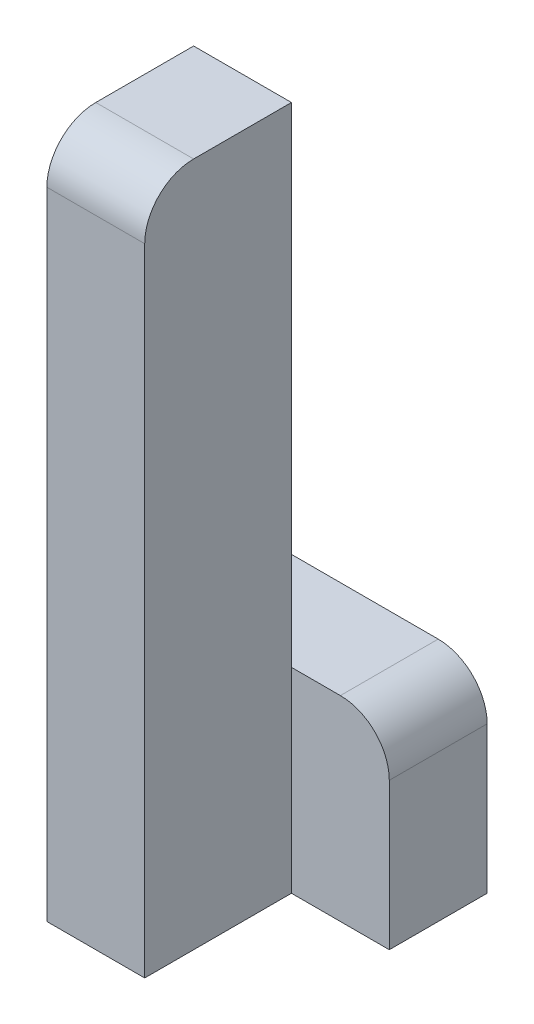
ISO-10303-21;
HEADER;
FILE_DESCRIPTION(('STEP AP214'),'2;1');
FILE_NAME('part.step','',(''),(''),'','','');
FILE_SCHEMA(('AUTOMOTIVE_DESIGN { 1 0 10303 214 1 1 1 1 }'));
ENDSEC;
DATA;
#1=APPLICATION_CONTEXT('core data for automotive mechanical design processes');
#2=APPLICATION_PROTOCOL_DEFINITION('international standard','automotive_design',2000,#1);
#3=PRODUCT_CONTEXT('',#1,'mechanical');
#4=PRODUCT('Part','Part','',(#3));
#5=PRODUCT_RELATED_PRODUCT_CATEGORY('part','',(#4));
#6=PRODUCT_DEFINITION_FORMATION('','',#4);
#7=PRODUCT_DEFINITION_CONTEXT('part definition',#1,'design');
#8=PRODUCT_DEFINITION('design','',#6,#7);
#9=PRODUCT_DEFINITION_SHAPE('','',#8);
#10=(LENGTH_UNIT() NAMED_UNIT(*) SI_UNIT(.MILLI.,.METRE.));
#11=(NAMED_UNIT(*) PLANE_ANGLE_UNIT() SI_UNIT($,.RADIAN.));
#12=(NAMED_UNIT(*) SI_UNIT($,.STERADIAN.) SOLID_ANGLE_UNIT());
#13=UNCERTAINTY_MEASURE_WITH_UNIT(LENGTH_MEASURE(1.E-05),#10,'distance_accuracy_value','');
#14=(GEOMETRIC_REPRESENTATION_CONTEXT(3) GLOBAL_UNCERTAINTY_ASSIGNED_CONTEXT((#13)) GLOBAL_UNIT_ASSIGNED_CONTEXT((#10,
#11,#12)) REPRESENTATION_CONTEXT('',''));
#15=CARTESIAN_POINT('',(0.,0.,0.));
#16=DIRECTION('',(0.,0.,1.));
#17=DIRECTION('',(1.,0.,0.));
#18=AXIS2_PLACEMENT_3D('',#15,#16,#17);
#19=CARTESIAN_POINT('',(-10.,0.,30.));
#20=DIRECTION('',(0.,-1.,0.));
#21=DIRECTION('',(1.,0.,0.));
#22=AXIS2_PLACEMENT_3D('',#19,#20,#21);
#23=PLANE('',#22);
#24=DIRECTION('',(0.,0.,-1.));
#25=VECTOR('',#24,1.);
#26=CARTESIAN_POINT('',(-30.,0.,30.));
#27=LINE('',#26,#25);
#28=CARTESIAN_POINT('',(-30.,0.,20.));
#29=VERTEX_POINT('',#28);
#30=CARTESIAN_POINT('',(-30.,0.,0.));
#31=VERTEX_POINT('',#30);
#32=EDGE_CURVE('E171',#29,#31,#27,.T.);
#33=ORIENTED_EDGE('',*,*,#32,.F.);
#34=DIRECTION('',(-1.,0.,0.));
#35=VECTOR('',#34,1.);
#36=CARTESIAN_POINT('',(-10.,0.,20.));
#37=LINE('',#36,#35);
#38=CARTESIAN_POINT('',(-10.,0.,20.));
#39=VERTEX_POINT('',#38);
#40=EDGE_CURVE('E43',#29,#39,#37,.F.);
#41=ORIENTED_EDGE('',*,*,#40,.T.);
#42=DIRECTION('',(0.,0.,-1.));
#43=VECTOR('',#42,1.);
#44=CARTESIAN_POINT('',(-10.,0.,30.));
#45=LINE('',#44,#43);
#46=CARTESIAN_POINT('',(-10.,0.,0.));
#47=VERTEX_POINT('',#46);
#48=EDGE_CURVE('E158',#39,#47,#45,.T.);
#49=ORIENTED_EDGE('',*,*,#48,.T.);
#50=DIRECTION('',(-1.,0.,0.));
#51=VECTOR('',#50,1.);
#52=CARTESIAN_POINT('',(-10.,0.,0.));
#53=LINE('',#52,#51);
#54=EDGE_CURVE('E148',#47,#31,#53,.T.);
#55=ORIENTED_EDGE('',*,*,#54,.T.);
#56=EDGE_LOOP('',(#33,#41,#49,#55));
#57=FACE_BOUND('',#56,.T.);
#58=ADVANCED_FACE('F35',(#57),#23,.F.);
#59=CARTESIAN_POINT('',(-30.,0.,30.));
#60=DIRECTION('',(1.,0.,0.));
#61=DIRECTION('',(0.,0.,-1.));
#62=AXIS2_PLACEMENT_3D('',#59,#60,#61);
#63=PLANE('',#62);
#64=DIRECTION('',(0.,-1.,0.));
#65=VECTOR('',#64,1.);
#66=CARTESIAN_POINT('',(-30.,0.,30.));
#67=LINE('',#66,#65);
#68=CARTESIAN_POINT('',(-30.,-10.,30.));
#69=VERTEX_POINT('',#68);
#70=CARTESIAN_POINT('',(-30.,-140.,30.));
#71=VERTEX_POINT('',#70);
#72=EDGE_CURVE('E150',#69,#71,#67,.T.);
#73=ORIENTED_EDGE('',*,*,#72,.F.);
#74=CARTESIAN_POINT('',(-30.,-10.,20.));
#75=DIRECTION('',(1.,0.,0.));
#76=DIRECTION('',(0.,0.,-1.));
#77=AXIS2_PLACEMENT_3D('',#74,#75,#76);
#78=CIRCLE('',#77,10.);
#79=EDGE_CURVE('E57',#69,#29,#78,.F.);
#80=ORIENTED_EDGE('',*,*,#79,.T.);
#81=ORIENTED_EDGE('',*,*,#32,.T.);
#82=DIRECTION('',(0.,-1.,0.));
#83=VECTOR('',#82,1.);
#84=CARTESIAN_POINT('',(-30.,0.,0.));
#85=LINE('',#84,#83);
#86=CARTESIAN_POINT('',(-30.,-100.,0.));
#87=VERTEX_POINT('',#86);
#88=EDGE_CURVE('E126',#31,#87,#85,.T.);
#89=ORIENTED_EDGE('',*,*,#88,.T.);
#90=DIRECTION('',(0.,0.,1.));
#91=VECTOR('',#90,1.);
#92=CARTESIAN_POINT('',(-30.,-100.,-20.));
#93=LINE('',#92,#91);
#94=CARTESIAN_POINT('',(-30.,-100.,-20.));
#95=VERTEX_POINT('',#94);
#96=EDGE_CURVE('E111',#95,#87,#93,.T.);
#97=ORIENTED_EDGE('',*,*,#96,.F.);
#98=DIRECTION('',(0.,-1.,0.));
#99=VECTOR('',#98,1.);
#100=CARTESIAN_POINT('',(-30.,-100.,-20.));
#101=LINE('',#100,#99);
#102=CARTESIAN_POINT('',(-30.,-140.,-20.));
#103=VERTEX_POINT('',#102);
#104=EDGE_CURVE('E118',#95,#103,#101,.T.);
#105=ORIENTED_EDGE('',*,*,#104,.T.);
#106=DIRECTION('',(0.,0.,-1.));
#107=VECTOR('',#106,1.);
#108=CARTESIAN_POINT('',(-30.,-140.,30.));
#109=LINE('',#108,#107);
#110=EDGE_CURVE('E169',#71,#103,#109,.T.);
#111=ORIENTED_EDGE('',*,*,#110,.F.);
#112=EDGE_LOOP('',(#73,#80,#81,#89,#97,#105,#111));
#113=FACE_BOUND('',#112,.T.);
#114=ADVANCED_FACE('F123',(#113),#63,.F.);
#115=CARTESIAN_POINT('',(-30.,-140.,30.));
#116=DIRECTION('',(0.,1.,0.));
#117=DIRECTION('',(0.,0.,1.));
#118=AXIS2_PLACEMENT_3D('',#115,#116,#117);
#119=PLANE('',#118);
#120=ORIENTED_EDGE('',*,*,#110,.T.);
#121=DIRECTION('',(1.,0.,0.));
#122=VECTOR('',#121,1.);
#123=CARTESIAN_POINT('',(-30.,-140.,-20.));
#124=LINE('',#123,#122);
#125=CARTESIAN_POINT('',(10.,-140.,-20.));
#126=VERTEX_POINT('',#125);
#127=EDGE_CURVE('E134',#103,#126,#124,.T.);
#128=ORIENTED_EDGE('',*,*,#127,.T.);
#129=DIRECTION('',(0.,0.,1.));
#130=VECTOR('',#129,1.);
#131=CARTESIAN_POINT('',(10.,-140.,-20.));
#132=LINE('',#131,#130);
#133=CARTESIAN_POINT('',(10.,-140.,0.));
#134=VERTEX_POINT('',#133);
#135=EDGE_CURVE('E127',#126,#134,#132,.T.);
#136=ORIENTED_EDGE('',*,*,#135,.T.);
#137=DIRECTION('',(1.,0.,0.));
#138=VECTOR('',#137,1.);
#139=CARTESIAN_POINT('',(-30.,-140.,0.));
#140=LINE('',#139,#138);
#141=CARTESIAN_POINT('',(-10.,-140.,0.));
#142=VERTEX_POINT('',#141);
#143=EDGE_CURVE('E142',#142,#134,#140,.T.);
#144=ORIENTED_EDGE('',*,*,#143,.F.);
#145=DIRECTION('',(0.,0.,-1.));
#146=VECTOR('',#145,1.);
#147=CARTESIAN_POINT('',(-10.,-140.,30.));
#148=LINE('',#147,#146);
#149=CARTESIAN_POINT('',(-10.,-140.,30.));
#150=VERTEX_POINT('',#149);
#151=EDGE_CURVE('E166',#150,#142,#148,.T.);
#152=ORIENTED_EDGE('',*,*,#151,.F.);
#153=DIRECTION('',(1.,0.,0.));
#154=VECTOR('',#153,1.);
#155=CARTESIAN_POINT('',(-30.,-140.,30.));
#156=LINE('',#155,#154);
#157=EDGE_CURVE('E152',#71,#150,#156,.T.);
#158=ORIENTED_EDGE('',*,*,#157,.F.);
#159=EDGE_LOOP('',(#120,#128,#136,#144,#152,#158));
#160=FACE_BOUND('',#159,.T.);
#161=ADVANCED_FACE('F193',(#160),#119,.F.);
#162=CARTESIAN_POINT('',(-10.,-140.,30.));
#163=DIRECTION('',(-1.,0.,0.));
#164=DIRECTION('',(0.,0.,1.));
#165=AXIS2_PLACEMENT_3D('',#162,#163,#164);
#166=PLANE('',#165);
#167=ORIENTED_EDGE('',*,*,#48,.F.);
#168=CARTESIAN_POINT('',(-10.,-10.,20.));
#169=DIRECTION('',(-1.,0.,0.));
#170=DIRECTION('',(0.,0.,1.));
#171=AXIS2_PLACEMENT_3D('',#168,#169,#170);
#172=CIRCLE('',#171,10.);
#173=CARTESIAN_POINT('',(-10.,-10.,30.));
#174=VERTEX_POINT('',#173);
#175=EDGE_CURVE('E11',#39,#174,#172,.F.);
#176=ORIENTED_EDGE('',*,*,#175,.T.);
#177=DIRECTION('',(0.,1.,0.));
#178=VECTOR('',#177,1.);
#179=CARTESIAN_POINT('',(-10.,-140.,30.));
#180=LINE('',#179,#178);
#181=EDGE_CURVE('E155',#150,#174,#180,.T.);
#182=ORIENTED_EDGE('',*,*,#181,.F.);
#183=ORIENTED_EDGE('',*,*,#151,.T.);
#184=DIRECTION('',(0.,1.,0.));
#185=VECTOR('',#184,1.);
#186=CARTESIAN_POINT('',(-10.,-140.,0.));
#187=LINE('',#186,#185);
#188=CARTESIAN_POINT('',(-10.,-100.,0.));
#189=VERTEX_POINT('',#188);
#190=EDGE_CURVE('E153',#142,#189,#187,.T.);
#191=ORIENTED_EDGE('',*,*,#190,.T.);
#192=EDGE_CURVE('E162',#189,#47,#187,.T.);
#193=ORIENTED_EDGE('',*,*,#192,.T.);
#194=EDGE_LOOP('',(#167,#176,#182,#183,#191,#193));
#195=FACE_BOUND('',#194,.T.);
#196=ADVANCED_FACE('F196',(#195),#166,.F.);
#197=CARTESIAN_POINT('',(0.,0.,30.));
#198=DIRECTION('',(0.,0.,1.));
#199=DIRECTION('',(1.,0.,0.));
#200=AXIS2_PLACEMENT_3D('',#197,#198,#199);
#201=PLANE('',#200);
#202=ORIENTED_EDGE('',*,*,#181,.T.);
#203=DIRECTION('',(-1.,0.,0.));
#204=VECTOR('',#203,1.);
#205=CARTESIAN_POINT('',(-30.,-10.,30.));
#206=LINE('',#205,#204);
#207=EDGE_CURVE('E181',#174,#69,#206,.T.);
#208=ORIENTED_EDGE('',*,*,#207,.T.);
#209=ORIENTED_EDGE('',*,*,#72,.T.);
#210=ORIENTED_EDGE('',*,*,#157,.T.);
#211=EDGE_LOOP('',(#202,#208,#209,#210));
#212=FACE_BOUND('',#211,.T.);
#213=ADVANCED_FACE('F186',(#212),#201,.T.);
#214=CARTESIAN_POINT('',(0.,0.,0.));
#215=DIRECTION('',(0.,0.,1.));
#216=DIRECTION('',(1.,0.,0.));
#217=AXIS2_PLACEMENT_3D('',#214,#215,#216);
#218=PLANE('',#217);
#219=ORIENTED_EDGE('',*,*,#192,.F.);
#220=DIRECTION('',(-1.,0.,0.));
#221=VECTOR('',#220,1.);
#222=CARTESIAN_POINT('',(10.,-100.,0.));
#223=LINE('',#222,#221);
#224=EDGE_CURVE('E143',#189,#87,#223,.T.);
#225=ORIENTED_EDGE('',*,*,#224,.T.);
#226=ORIENTED_EDGE('',*,*,#88,.F.);
#227=ORIENTED_EDGE('',*,*,#54,.F.);
#228=EDGE_LOOP('',(#219,#225,#226,#227));
#229=FACE_BOUND('',#228,.T.);
#230=ADVANCED_FACE('F215',(#229),#218,.F.);
#231=CARTESIAN_POINT('',(0.,0.,0.));
#232=DIRECTION('',(0.,0.,1.));
#233=DIRECTION('',(1.,0.,0.));
#234=AXIS2_PLACEMENT_3D('',#231,#232,#233);
#235=PLANE('',#234);
#236=DIRECTION('',(0.,1.,0.));
#237=VECTOR('',#236,1.);
#238=CARTESIAN_POINT('',(10.,-140.,0.));
#239=LINE('',#238,#237);
#240=CARTESIAN_POINT('',(10.,-110.,0.));
#241=VERTEX_POINT('',#240);
#242=EDGE_CURVE('E119',#134,#241,#239,.T.);
#243=ORIENTED_EDGE('',*,*,#242,.T.);
#244=CARTESIAN_POINT('',(0.,-110.,0.));
#245=DIRECTION('',(0.,0.,1.));
#246=DIRECTION('',(1.,0.,0.));
#247=AXIS2_PLACEMENT_3D('',#244,#245,#246);
#248=CIRCLE('',#247,10.);
#249=CARTESIAN_POINT('',(0.,-100.,0.));
#250=VERTEX_POINT('',#249);
#251=EDGE_CURVE('E176',#241,#250,#248,.T.);
#252=ORIENTED_EDGE('',*,*,#251,.T.);
#253=EDGE_CURVE('E140',#250,#189,#223,.T.);
#254=ORIENTED_EDGE('',*,*,#253,.T.);
#255=ORIENTED_EDGE('',*,*,#190,.F.);
#256=ORIENTED_EDGE('',*,*,#143,.T.);
#257=EDGE_LOOP('',(#243,#252,#254,#255,#256));
#258=FACE_BOUND('',#257,.T.);
#259=ADVANCED_FACE('F218',(#258),#235,.T.);
#260=CARTESIAN_POINT('',(10.,-100.,-20.));
#261=DIRECTION('',(0.,1.,0.));
#262=DIRECTION('',(0.,0.,1.));
#263=AXIS2_PLACEMENT_3D('',#260,#261,#262);
#264=PLANE('',#263);
#265=ORIENTED_EDGE('',*,*,#253,.F.);
#266=DIRECTION('',(0.,0.,1.));
#267=VECTOR('',#266,1.);
#268=CARTESIAN_POINT('',(0.,-100.,-20.));
#269=LINE('',#268,#267);
#270=CARTESIAN_POINT('',(0.,-100.,-20.));
#271=VERTEX_POINT('',#270);
#272=EDGE_CURVE('E114',#250,#271,#269,.F.);
#273=ORIENTED_EDGE('',*,*,#272,.T.);
#274=DIRECTION('',(-1.,0.,0.));
#275=VECTOR('',#274,1.);
#276=CARTESIAN_POINT('',(10.,-100.,-20.));
#277=LINE('',#276,#275);
#278=EDGE_CURVE('E106',#271,#95,#277,.T.);
#279=ORIENTED_EDGE('',*,*,#278,.T.);
#280=ORIENTED_EDGE('',*,*,#96,.T.);
#281=ORIENTED_EDGE('',*,*,#224,.F.);
#282=EDGE_LOOP('',(#265,#273,#279,#280,#281));
#283=FACE_BOUND('',#282,.T.);
#284=ADVANCED_FACE('F109',(#283),#264,.T.);
#285=CARTESIAN_POINT('',(10.,-140.,-20.));
#286=DIRECTION('',(1.,0.,0.));
#287=DIRECTION('',(0.,0.,-1.));
#288=AXIS2_PLACEMENT_3D('',#285,#286,#287);
#289=PLANE('',#288);
#290=DIRECTION('',(0.,1.,0.));
#291=VECTOR('',#290,1.);
#292=CARTESIAN_POINT('',(10.,-140.,-20.));
#293=LINE('',#292,#291);
#294=CARTESIAN_POINT('',(10.,-110.,-20.));
#295=VERTEX_POINT('',#294);
#296=EDGE_CURVE('E128',#126,#295,#293,.T.);
#297=ORIENTED_EDGE('',*,*,#296,.T.);
#298=DIRECTION('',(0.,0.,1.));
#299=VECTOR('',#298,1.);
#300=CARTESIAN_POINT('',(10.,-110.,-20.));
#301=LINE('',#300,#299);
#302=EDGE_CURVE('E173',#295,#241,#301,.T.);
#303=ORIENTED_EDGE('',*,*,#302,.T.);
#304=ORIENTED_EDGE('',*,*,#242,.F.);
#305=ORIENTED_EDGE('',*,*,#135,.F.);
#306=EDGE_LOOP('',(#297,#303,#304,#305));
#307=FACE_BOUND('',#306,.T.);
#308=ADVANCED_FACE('F224',(#307),#289,.T.);
#309=CARTESIAN_POINT('',(0.,0.,-20.));
#310=DIRECTION('',(0.,0.,1.));
#311=DIRECTION('',(1.,0.,0.));
#312=AXIS2_PLACEMENT_3D('',#309,#310,#311);
#313=PLANE('',#312);
#314=ORIENTED_EDGE('',*,*,#278,.F.);
#315=CARTESIAN_POINT('',(0.,-110.,-20.));
#316=DIRECTION('',(0.,0.,1.));
#317=DIRECTION('',(1.,0.,0.));
#318=AXIS2_PLACEMENT_3D('',#315,#316,#317);
#319=CIRCLE('',#318,10.);
#320=EDGE_CURVE('E179',#271,#295,#319,.F.);
#321=ORIENTED_EDGE('',*,*,#320,.T.);
#322=ORIENTED_EDGE('',*,*,#296,.F.);
#323=ORIENTED_EDGE('',*,*,#127,.F.);
#324=ORIENTED_EDGE('',*,*,#104,.F.);
#325=EDGE_LOOP('',(#314,#321,#322,#323,#324));
#326=FACE_BOUND('',#325,.T.);
#327=ADVANCED_FACE('F131',(#326),#313,.F.);
#328=CARTESIAN_POINT('',(0.,-110.,-20.));
#329=DIRECTION('',(0.,0.,1.));
#330=DIRECTION('',(1.,0.,0.));
#331=AXIS2_PLACEMENT_3D('',#328,#329,#330);
#332=CYLINDRICAL_SURFACE('',#331,10.);
#333=ORIENTED_EDGE('',*,*,#320,.F.);
#334=ORIENTED_EDGE('',*,*,#272,.F.);
#335=ORIENTED_EDGE('',*,*,#251,.F.);
#336=ORIENTED_EDGE('',*,*,#302,.F.);
#337=EDGE_LOOP('',(#333,#334,#335,#336));
#338=FACE_BOUND('',#337,.T.);
#339=ADVANCED_FACE('F199',(#338),#332,.T.);
#340=CARTESIAN_POINT('',(0.,-10.,20.));
#341=DIRECTION('',(1.,0.,0.));
#342=DIRECTION('',(0.,1.,0.));
#343=AXIS2_PLACEMENT_3D('',#340,#341,#342);
#344=CYLINDRICAL_SURFACE('',#343,10.);
#345=ORIENTED_EDGE('',*,*,#175,.F.);
#346=ORIENTED_EDGE('',*,*,#40,.F.);
#347=ORIENTED_EDGE('',*,*,#79,.F.);
#348=ORIENTED_EDGE('',*,*,#207,.F.);
#349=EDGE_LOOP('',(#345,#346,#347,#348));
#350=FACE_BOUND('',#349,.T.);
#351=ADVANCED_FACE('F37',(#350),#344,.T.);
#352=CLOSED_SHELL('',(#58,#114,#161,#196,#213,#230,#259,#284,#308,#327,#339,#351));
#353=MANIFOLD_SOLID_BREP('B2',#352);
#354=ADVANCED_BREP_SHAPE_REPRESENTATION('',(#18,#353),#14);
#355=SHAPE_DEFINITION_REPRESENTATION(#9,#354);
ENDSEC;
END-ISO-10303-21;
